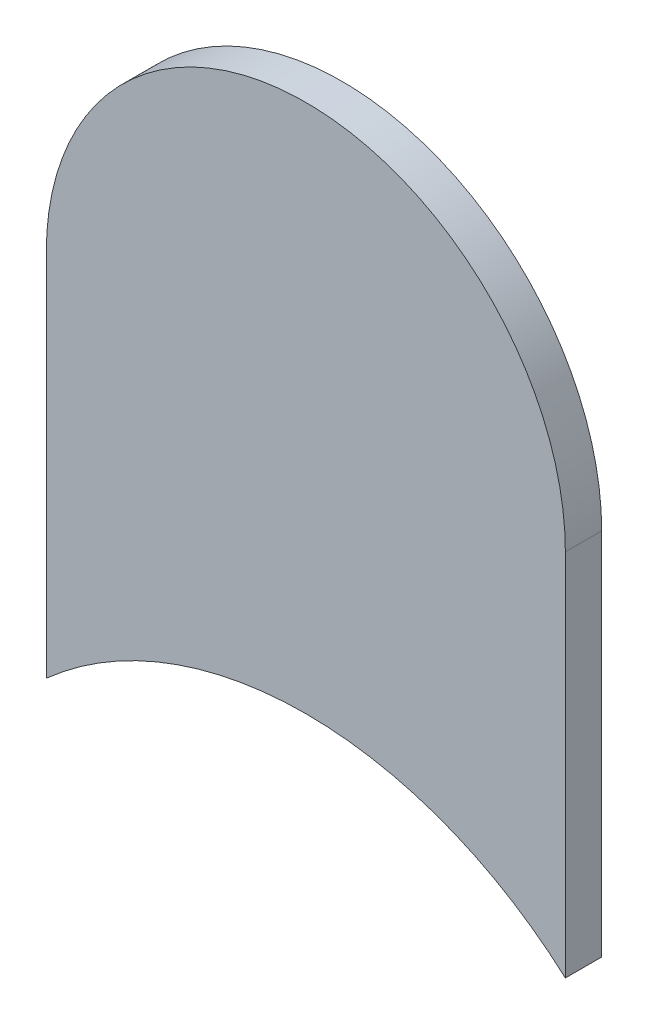
ISO-10303-21;
HEADER;
FILE_DESCRIPTION(('STEP AP214'),'2;1');
FILE_NAME('part.step','',(''),(''),'','','');
FILE_SCHEMA(('AUTOMOTIVE_DESIGN { 1 0 10303 214 1 1 1 1 }'));
ENDSEC;
DATA;
#1=APPLICATION_CONTEXT('core data for automotive mechanical design processes');
#2=APPLICATION_PROTOCOL_DEFINITION('international standard','automotive_design',2000,#1);
#3=PRODUCT_CONTEXT('',#1,'mechanical');
#4=PRODUCT('Part','Part','',(#3));
#5=PRODUCT_RELATED_PRODUCT_CATEGORY('part','',(#4));
#6=PRODUCT_DEFINITION_FORMATION('','',#4);
#7=PRODUCT_DEFINITION_CONTEXT('part definition',#1,'design');
#8=PRODUCT_DEFINITION('design','',#6,#7);
#9=PRODUCT_DEFINITION_SHAPE('','',#8);
#10=(LENGTH_UNIT() NAMED_UNIT(*) SI_UNIT(.MILLI.,.METRE.));
#11=(NAMED_UNIT(*) PLANE_ANGLE_UNIT() SI_UNIT($,.RADIAN.));
#12=(NAMED_UNIT(*) SI_UNIT($,.STERADIAN.) SOLID_ANGLE_UNIT());
#13=UNCERTAINTY_MEASURE_WITH_UNIT(LENGTH_MEASURE(1.E-05),#10,'distance_accuracy_value','');
#14=(GEOMETRIC_REPRESENTATION_CONTEXT(3) GLOBAL_UNCERTAINTY_ASSIGNED_CONTEXT((#13)) GLOBAL_UNIT_ASSIGNED_CONTEXT((#10,
#11,#12)) REPRESENTATION_CONTEXT('',''));
#15=CARTESIAN_POINT('',(0.,0.,0.));
#16=DIRECTION('',(0.,0.,1.));
#17=DIRECTION('',(1.,0.,0.));
#18=AXIS2_PLACEMENT_3D('',#15,#16,#17);
#19=CARTESIAN_POINT('',(167.89,-103.632,-0.035));
#20=DIRECTION('',(-1.,0.,0.));
#21=DIRECTION('',(0.,0.,1.));
#22=AXIS2_PLACEMENT_3D('',#19,#20,#21);
#23=PLANE('',#22);
#24=DIRECTION('',(0.,0.,1.));
#25=VECTOR('',#24,1.);
#26=CARTESIAN_POINT('',(167.89,-102.997,-0.035));
#27=LINE('',#26,#25);
#28=CARTESIAN_POINT('',(167.89,-102.997,-0.035));
#29=VERTEX_POINT('',#28);
#30=CARTESIAN_POINT('',(167.89,-102.997,0.));
#31=VERTEX_POINT('',#30);
#32=EDGE_CURVE('E11',#29,#31,#27,.T.);
#33=ORIENTED_EDGE('',*,*,#32,.T.);
#34=DIRECTION('',(0.,1.,0.));
#35=VECTOR('',#34,1.);
#36=CARTESIAN_POINT('',(167.89,-103.632,0.));
#37=LINE('',#36,#35);
#38=CARTESIAN_POINT('',(167.89,-103.3524915028,0.));
#39=VERTEX_POINT('',#38);
#40=EDGE_CURVE('E26',#39,#31,#37,.T.);
#41=ORIENTED_EDGE('',*,*,#40,.F.);
#42=DIRECTION('',(0.,0.,-1.));
#43=VECTOR('',#42,1.);
#44=CARTESIAN_POINT('',(167.89,-103.3524915028,-0.045));
#45=LINE('',#44,#43);
#46=CARTESIAN_POINT('',(167.89,-103.3524915028,-0.035));
#47=VERTEX_POINT('',#46);
#48=EDGE_CURVE('E47',#39,#47,#45,.T.);
#49=ORIENTED_EDGE('',*,*,#48,.T.);
#50=DIRECTION('',(0.,1.,0.));
#51=VECTOR('',#50,1.);
#52=CARTESIAN_POINT('',(167.89,-103.632,-0.035));
#53=LINE('',#52,#51);
#54=EDGE_CURVE('E102',#47,#29,#53,.T.);
#55=ORIENTED_EDGE('',*,*,#54,.T.);
#56=EDGE_LOOP('',(#33,#41,#49,#55));
#57=FACE_BOUND('',#56,.T.);
#58=ADVANCED_FACE('F17',(#57),#23,.F.);
#59=CARTESIAN_POINT('',(167.64,-102.997,-0.035));
#60=DIRECTION('',(0.,0.,-1.));
#61=DIRECTION('',(1.,0.,0.));
#62=AXIS2_PLACEMENT_3D('',#59,#60,#61);
#63=CYLINDRICAL_SURFACE('',#62,0.25);
#64=CARTESIAN_POINT('',(167.64,-102.997,-0.035));
#65=DIRECTION('',(0.,0.,1.));
#66=DIRECTION('',(1.,0.,0.));
#67=AXIS2_PLACEMENT_3D('',#64,#65,#66);
#68=CIRCLE('',#67,0.25);
#69=CARTESIAN_POINT('',(167.39,-102.997,-0.035));
#70=VERTEX_POINT('',#69);
#71=EDGE_CURVE('E58',#29,#70,#68,.T.);
#72=ORIENTED_EDGE('',*,*,#71,.T.);
#73=DIRECTION('',(0.,0.,1.));
#74=VECTOR('',#73,1.);
#75=CARTESIAN_POINT('',(167.39,-102.997,-0.035));
#76=LINE('',#75,#74);
#77=CARTESIAN_POINT('',(167.39,-102.997,0.));
#78=VERTEX_POINT('',#77);
#79=EDGE_CURVE('E91',#70,#78,#76,.T.);
#80=ORIENTED_EDGE('',*,*,#79,.T.);
#81=CARTESIAN_POINT('',(167.64,-102.997,0.));
#82=DIRECTION('',(0.,0.,1.));
#83=DIRECTION('',(1.,0.,0.));
#84=AXIS2_PLACEMENT_3D('',#81,#82,#83);
#85=CIRCLE('',#84,0.25);
#86=EDGE_CURVE('E67',#31,#78,#85,.T.);
#87=ORIENTED_EDGE('',*,*,#86,.F.);
#88=ORIENTED_EDGE('',*,*,#32,.F.);
#89=EDGE_LOOP('',(#72,#80,#87,#88));
#90=FACE_BOUND('',#89,.T.);
#91=ADVANCED_FACE('F119',(#90),#63,.T.);
#92=CARTESIAN_POINT('',(167.39,-102.997,0.));
#93=DIRECTION('',(0.,0.,1.));
#94=DIRECTION('',(1.,0.,0.));
#95=AXIS2_PLACEMENT_3D('',#92,#93,#94);
#96=PLANE('',#95);
#97=ORIENTED_EDGE('',*,*,#86,.T.);
#98=DIRECTION('',(0.,-1.,0.));
#99=VECTOR('',#98,1.);
#100=CARTESIAN_POINT('',(167.39,-102.997,0.));
#101=LINE('',#100,#99);
#102=CARTESIAN_POINT('',(167.39,-103.3524915028,0.));
#103=VERTEX_POINT('',#102);
#104=EDGE_CURVE('E86',#78,#103,#101,.T.);
#105=ORIENTED_EDGE('',*,*,#104,.T.);
#106=CARTESIAN_POINT('',(167.64,-103.632,0.));
#107=DIRECTION('',(0.,0.,-1.));
#108=DIRECTION('',(0.,-1.,0.));
#109=AXIS2_PLACEMENT_3D('',#106,#107,#108);
#110=CIRCLE('',#109,0.375);
#111=EDGE_CURVE('E79',#103,#39,#110,.T.);
#112=ORIENTED_EDGE('',*,*,#111,.T.);
#113=ORIENTED_EDGE('',*,*,#40,.T.);
#114=EDGE_LOOP('',(#97,#105,#112,#113));
#115=FACE_BOUND('',#114,.T.);
#116=ADVANCED_FACE('F87',(#115),#96,.T.);
#117=CARTESIAN_POINT('',(167.64,-103.632,-0.045));
#118=DIRECTION('',(0.,0.,-1.));
#119=DIRECTION('',(0.,-1.,0.));
#120=AXIS2_PLACEMENT_3D('',#117,#118,#119);
#121=CYLINDRICAL_SURFACE('',#120,0.375);
#122=ORIENTED_EDGE('',*,*,#111,.F.);
#123=DIRECTION('',(0.,0.,-1.));
#124=VECTOR('',#123,1.);
#125=CARTESIAN_POINT('',(167.39,-103.3524915028,-0.045));
#126=LINE('',#125,#124);
#127=CARTESIAN_POINT('',(167.39,-103.3524915028,-0.035));
#128=VERTEX_POINT('',#127);
#129=EDGE_CURVE('E82',#103,#128,#126,.T.);
#130=ORIENTED_EDGE('',*,*,#129,.T.);
#131=CARTESIAN_POINT('',(167.64,-103.632,-0.035));
#132=DIRECTION('',(0.,0.,-1.));
#133=DIRECTION('',(0.,-1.,0.));
#134=AXIS2_PLACEMENT_3D('',#131,#132,#133);
#135=CIRCLE('',#134,0.375);
#136=EDGE_CURVE('E108',#128,#47,#135,.T.);
#137=ORIENTED_EDGE('',*,*,#136,.T.);
#138=ORIENTED_EDGE('',*,*,#48,.F.);
#139=EDGE_LOOP('',(#122,#130,#137,#138));
#140=FACE_BOUND('',#139,.T.);
#141=ADVANCED_FACE('F80',(#140),#121,.F.);
#142=CARTESIAN_POINT('',(167.39,-102.997,-0.035));
#143=DIRECTION('',(0.,0.,1.));
#144=DIRECTION('',(1.,0.,0.));
#145=AXIS2_PLACEMENT_3D('',#142,#143,#144);
#146=PLANE('',#145);
#147=ORIENTED_EDGE('',*,*,#54,.F.);
#148=ORIENTED_EDGE('',*,*,#136,.F.);
#149=DIRECTION('',(0.,-1.,0.));
#150=VECTOR('',#149,1.);
#151=CARTESIAN_POINT('',(167.39,-102.997,-0.035));
#152=LINE('',#151,#150);
#153=EDGE_CURVE('E95',#70,#128,#152,.T.);
#154=ORIENTED_EDGE('',*,*,#153,.F.);
#155=ORIENTED_EDGE('',*,*,#71,.F.);
#156=EDGE_LOOP('',(#147,#148,#154,#155));
#157=FACE_BOUND('',#156,.T.);
#158=ADVANCED_FACE('F122',(#157),#146,.F.);
#159=CARTESIAN_POINT('',(167.39,-102.997,-0.035));
#160=DIRECTION('',(1.,0.,0.));
#161=DIRECTION('',(0.,1.,0.));
#162=AXIS2_PLACEMENT_3D('',#159,#160,#161);
#163=PLANE('',#162);
#164=ORIENTED_EDGE('',*,*,#129,.F.);
#165=ORIENTED_EDGE('',*,*,#104,.F.);
#166=ORIENTED_EDGE('',*,*,#79,.F.);
#167=ORIENTED_EDGE('',*,*,#153,.T.);
#168=EDGE_LOOP('',(#164,#165,#166,#167));
#169=FACE_BOUND('',#168,.T.);
#170=ADVANCED_FACE('F94',(#169),#163,.F.);
#171=CLOSED_SHELL('',(#58,#91,#116,#141,#158,#170));
#172=MANIFOLD_SOLID_BREP('B1',#171);
#173=ADVANCED_BREP_SHAPE_REPRESENTATION('',(#18,#172),#14);
#174=SHAPE_DEFINITION_REPRESENTATION(#9,#173);
ENDSEC;
END-ISO-10303-21;
